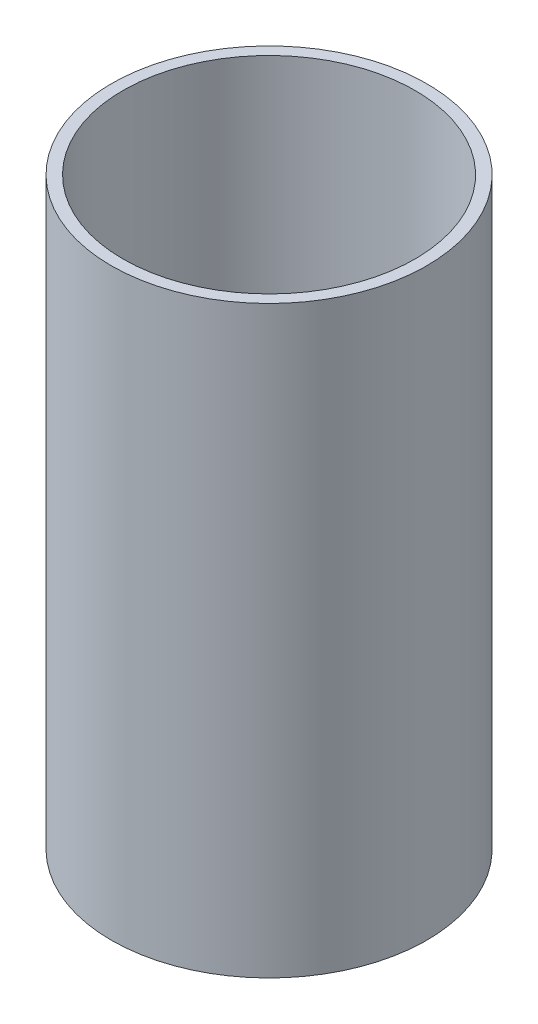
ISO-10303-21;
HEADER;
FILE_DESCRIPTION(('STEP AP214'),'2;1');
FILE_NAME('part.step','',(''),(''),'','','');
FILE_SCHEMA(('AUTOMOTIVE_DESIGN { 1 0 10303 214 1 1 1 1 }'));
ENDSEC;
DATA;
#1=APPLICATION_CONTEXT('core data for automotive mechanical design processes');
#2=APPLICATION_PROTOCOL_DEFINITION('international standard','automotive_design',2000,#1);
#3=PRODUCT_CONTEXT('',#1,'mechanical');
#4=PRODUCT('Part','Part','',(#3));
#5=PRODUCT_RELATED_PRODUCT_CATEGORY('part','',(#4));
#6=PRODUCT_DEFINITION_FORMATION('','',#4);
#7=PRODUCT_DEFINITION_CONTEXT('part definition',#1,'design');
#8=PRODUCT_DEFINITION('design','',#6,#7);
#9=PRODUCT_DEFINITION_SHAPE('','',#8);
#10=(LENGTH_UNIT() NAMED_UNIT(*) SI_UNIT(.MILLI.,.METRE.));
#11=(NAMED_UNIT(*) PLANE_ANGLE_UNIT() SI_UNIT($,.RADIAN.));
#12=(NAMED_UNIT(*) SI_UNIT($,.STERADIAN.) SOLID_ANGLE_UNIT());
#13=UNCERTAINTY_MEASURE_WITH_UNIT(LENGTH_MEASURE(1.E-05),#10,'distance_accuracy_value','');
#14=(GEOMETRIC_REPRESENTATION_CONTEXT(3) GLOBAL_UNCERTAINTY_ASSIGNED_CONTEXT((#13)) GLOBAL_UNIT_ASSIGNED_CONTEXT((#10,
#11,#12)) REPRESENTATION_CONTEXT('',''));
#15=CARTESIAN_POINT('',(0.,0.,0.));
#16=DIRECTION('',(0.,0.,1.));
#17=DIRECTION('',(1.,0.,0.));
#18=AXIS2_PLACEMENT_3D('',#15,#16,#17);
#19=CARTESIAN_POINT('',(0.,100.,0.));
#20=DIRECTION('',(0.,1.,0.));
#21=DIRECTION('',(0.,0.,1.));
#22=AXIS2_PLACEMENT_3D('',#19,#20,#21);
#23=PLANE('',#22);
#24=CARTESIAN_POINT('',(0.,100.,0.));
#25=DIRECTION('',(0.,1.,0.));
#26=DIRECTION('',(0.,0.,1.));
#27=AXIS2_PLACEMENT_3D('',#24,#25,#26);
#28=CIRCLE('',#27,27.);
#29=CARTESIAN_POINT('',(0.,100.,27.));
#30=VERTEX_POINT('',#29);
#31=EDGE_CURVE('E10',#30,#30,#28,.T.);
#32=ORIENTED_EDGE('',*,*,#31,.T.);
#33=EDGE_LOOP('',(#32));
#34=FACE_BOUND('',#33,.T.);
#35=CARTESIAN_POINT('',(0.,100.,0.));
#36=DIRECTION('',(0.,1.,0.));
#37=DIRECTION('',(0.,0.,1.));
#38=AXIS2_PLACEMENT_3D('',#35,#36,#37);
#39=CIRCLE('',#38,25.);
#40=CARTESIAN_POINT('',(0.,100.,25.));
#41=VERTEX_POINT('',#40);
#42=EDGE_CURVE('E46',#41,#41,#39,.T.);
#43=ORIENTED_EDGE('',*,*,#42,.F.);
#44=EDGE_LOOP('',(#43));
#45=FACE_BOUND('',#44,.T.);
#46=ADVANCED_FACE('F35',(#34,#45),#23,.T.);
#47=CARTESIAN_POINT('',(0.,0.,0.));
#48=DIRECTION('',(0.,1.,0.));
#49=DIRECTION('',(0.,0.,1.));
#50=AXIS2_PLACEMENT_3D('',#47,#48,#49);
#51=PLANE('',#50);
#52=CARTESIAN_POINT('',(0.,0.,0.));
#53=DIRECTION('',(0.,1.,0.));
#54=DIRECTION('',(0.,0.,1.));
#55=AXIS2_PLACEMENT_3D('',#52,#53,#54);
#56=CIRCLE('',#55,27.);
#57=CARTESIAN_POINT('',(0.,0.,27.));
#58=VERTEX_POINT('',#57);
#59=EDGE_CURVE('E39',#58,#58,#56,.T.);
#60=ORIENTED_EDGE('',*,*,#59,.F.);
#61=EDGE_LOOP('',(#60));
#62=FACE_BOUND('',#61,.T.);
#63=CARTESIAN_POINT('',(0.,0.,0.));
#64=DIRECTION('',(0.,1.,0.));
#65=DIRECTION('',(0.,0.,1.));
#66=AXIS2_PLACEMENT_3D('',#63,#64,#65);
#67=CIRCLE('',#66,25.);
#68=CARTESIAN_POINT('',(0.,0.,25.));
#69=VERTEX_POINT('',#68);
#70=EDGE_CURVE('E48',#69,#69,#67,.T.);
#71=ORIENTED_EDGE('',*,*,#70,.T.);
#72=EDGE_LOOP('',(#71));
#73=FACE_BOUND('',#72,.T.);
#74=ADVANCED_FACE('F58',(#62,#73),#51,.F.);
#75=CARTESIAN_POINT('',(0.,100.,0.));
#76=DIRECTION('',(0.,-1.,0.));
#77=DIRECTION('',(0.,0.,-1.));
#78=AXIS2_PLACEMENT_3D('',#75,#76,#77);
#79=CYLINDRICAL_SURFACE('',#78,27.);
#80=ORIENTED_EDGE('',*,*,#31,.F.);
#81=EDGE_LOOP('',(#80));
#82=FACE_BOUND('',#81,.T.);
#83=ORIENTED_EDGE('',*,*,#59,.T.);
#84=EDGE_LOOP('',(#83));
#85=FACE_BOUND('',#84,.T.);
#86=ADVANCED_FACE('F37',(#82,#85),#79,.T.);
#87=CARTESIAN_POINT('',(0.,100.,0.));
#88=DIRECTION('',(0.,-1.,0.));
#89=DIRECTION('',(0.,0.,-1.));
#90=AXIS2_PLACEMENT_3D('',#87,#88,#89);
#91=CYLINDRICAL_SURFACE('',#90,25.);
#92=ORIENTED_EDGE('',*,*,#42,.T.);
#93=EDGE_LOOP('',(#92));
#94=FACE_BOUND('',#93,.T.);
#95=ORIENTED_EDGE('',*,*,#70,.F.);
#96=EDGE_LOOP('',(#95));
#97=FACE_BOUND('',#96,.T.);
#98=ADVANCED_FACE('F54',(#94,#97),#91,.F.);
#99=CLOSED_SHELL('',(#46,#74,#86,#98));
#100=MANIFOLD_SOLID_BREP('B2',#99);
#101=ADVANCED_BREP_SHAPE_REPRESENTATION('',(#18,#100),#14);
#102=SHAPE_DEFINITION_REPRESENTATION(#9,#101);
ENDSEC;
END-ISO-10303-21;
